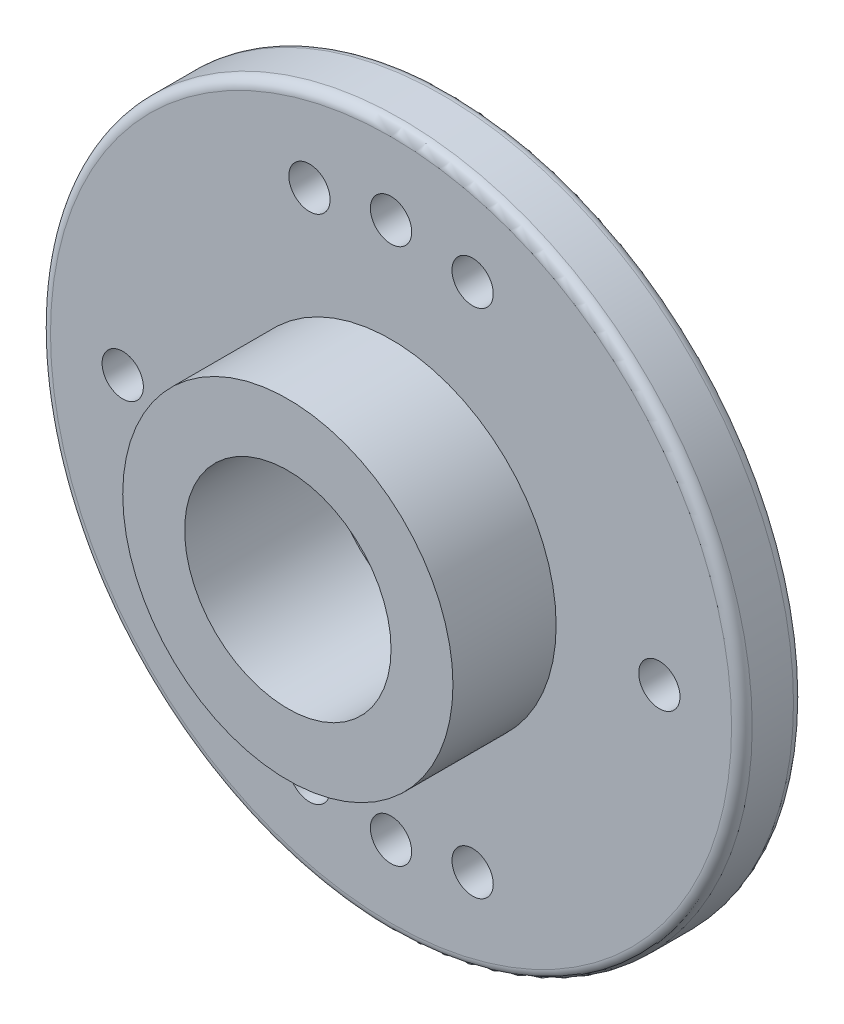
ISO-10303-21;
HEADER;
FILE_DESCRIPTION(('STEP AP214'),'2;1');
FILE_NAME('part.step','',(''),(''),'','','');
FILE_SCHEMA(('AUTOMOTIVE_DESIGN { 1 0 10303 214 1 1 1 1 }'));
ENDSEC;
DATA;
#1=APPLICATION_CONTEXT('core data for automotive mechanical design processes');
#2=APPLICATION_PROTOCOL_DEFINITION('international standard','automotive_design',2000,#1);
#3=PRODUCT_CONTEXT('',#1,'mechanical');
#4=PRODUCT('Part','Part','',(#3));
#5=PRODUCT_RELATED_PRODUCT_CATEGORY('part','',(#4));
#6=PRODUCT_DEFINITION_FORMATION('','',#4);
#7=PRODUCT_DEFINITION_CONTEXT('part definition',#1,'design');
#8=PRODUCT_DEFINITION('design','',#6,#7);
#9=PRODUCT_DEFINITION_SHAPE('','',#8);
#10=(LENGTH_UNIT() NAMED_UNIT(*) SI_UNIT(.MILLI.,.METRE.));
#11=(NAMED_UNIT(*) PLANE_ANGLE_UNIT() SI_UNIT($,.RADIAN.));
#12=(NAMED_UNIT(*) SI_UNIT($,.STERADIAN.) SOLID_ANGLE_UNIT());
#13=UNCERTAINTY_MEASURE_WITH_UNIT(LENGTH_MEASURE(1.E-05),#10,'distance_accuracy_value','');
#14=(GEOMETRIC_REPRESENTATION_CONTEXT(3) GLOBAL_UNCERTAINTY_ASSIGNED_CONTEXT((#13)) GLOBAL_UNIT_ASSIGNED_CONTEXT((#10,
#11,#12)) REPRESENTATION_CONTEXT('',''));
#15=CARTESIAN_POINT('',(0.,0.,0.));
#16=DIRECTION('',(0.,0.,1.));
#17=DIRECTION('',(1.,0.,0.));
#18=AXIS2_PLACEMENT_3D('',#15,#16,#17);
#19=CARTESIAN_POINT('',(0.,0.,0.));
#20=DIRECTION('',(0.,0.,1.));
#21=DIRECTION('',(1.,0.,0.));
#22=AXIS2_PLACEMENT_3D('',#19,#20,#21);
#23=PLANE('',#22);
#24=CARTESIAN_POINT('',(0.,0.,0.));
#25=DIRECTION('',(0.,0.,1.));
#26=DIRECTION('',(1.,0.,0.));
#27=AXIS2_PLACEMENT_3D('',#24,#25,#26);
#28=CIRCLE('',#27,1.25);
#29=CARTESIAN_POINT('',(1.25,0.,0.));
#30=VERTEX_POINT('',#29);
#31=EDGE_CURVE('E67',#30,#30,#28,.T.);
#32=ORIENTED_EDGE('',*,*,#31,.T.);
#33=EDGE_LOOP('',(#32));
#34=FACE_BOUND('',#33,.T.);
#35=CARTESIAN_POINT('',(0.,0.,0.));
#36=DIRECTION('',(0.,0.,1.));
#37=DIRECTION('',(1.,0.,0.));
#38=AXIS2_PLACEMENT_3D('',#35,#36,#37);
#39=CIRCLE('',#38,3.);
#40=CARTESIAN_POINT('',(3.,0.,0.));
#41=VERTEX_POINT('',#40);
#42=EDGE_CURVE('E58',#41,#41,#39,.T.);
#43=ORIENTED_EDGE('',*,*,#42,.F.);
#44=EDGE_LOOP('',(#43));
#45=FACE_BOUND('',#44,.T.);
#46=ADVANCED_FACE('F32',(#34,#45),#23,.F.);
#47=CARTESIAN_POINT('',(0.,0.,1.5));
#48=DIRECTION('',(0.,0.,1.));
#49=DIRECTION('',(1.,0.,0.));
#50=AXIS2_PLACEMENT_3D('',#47,#48,#49);
#51=PLANE('',#50);
#52=CARTESIAN_POINT('',(0.,0.,1.5));
#53=DIRECTION('',(0.,0.,1.));
#54=DIRECTION('',(1.,0.,0.));
#55=AXIS2_PLACEMENT_3D('',#52,#53,#54);
#56=CIRCLE('',#55,8.25);
#57=CARTESIAN_POINT('',(8.25,0.,1.5));
#58=VERTEX_POINT('',#57);
#59=EDGE_CURVE('E55',#58,#58,#56,.T.);
#60=ORIENTED_EDGE('',*,*,#59,.T.);
#61=EDGE_LOOP('',(#60));
#62=FACE_BOUND('',#61,.T.);
#63=CARTESIAN_POINT('',(0.,6.5,1.5));
#64=DIRECTION('',(0.,0.,1.));
#65=DIRECTION('',(1.,0.,0.));
#66=AXIS2_PLACEMENT_3D('',#63,#64,#65);
#67=CIRCLE('',#66,0.5);
#68=CARTESIAN_POINT('',(0.5,6.5,1.5));
#69=VERTEX_POINT('',#68);
#70=EDGE_CURVE('E95',#69,#69,#67,.T.);
#71=ORIENTED_EDGE('',*,*,#70,.F.);
#72=EDGE_LOOP('',(#71));
#73=FACE_BOUND('',#72,.T.);
#74=CARTESIAN_POINT('',(0.,-6.5,1.5));
#75=DIRECTION('',(0.,0.,1.));
#76=DIRECTION('',(1.,0.,0.));
#77=AXIS2_PLACEMENT_3D('',#74,#75,#76);
#78=CIRCLE('',#77,0.5);
#79=CARTESIAN_POINT('',(0.500000000000002,-6.5,1.5));
#80=VERTEX_POINT('',#79);
#81=EDGE_CURVE('E102',#80,#80,#78,.T.);
#82=ORIENTED_EDGE('',*,*,#81,.F.);
#83=EDGE_LOOP('',(#82));
#84=FACE_BOUND('',#83,.T.);
#85=CARTESIAN_POINT('',(-6.5,0.,1.5));
#86=DIRECTION('',(0.,0.,1.));
#87=DIRECTION('',(1.,0.,0.));
#88=AXIS2_PLACEMENT_3D('',#85,#86,#87);
#89=CIRCLE('',#88,0.500000000000001);
#90=CARTESIAN_POINT('',(-6.,0.,1.5));
#91=VERTEX_POINT('',#90);
#92=EDGE_CURVE('E105',#91,#91,#89,.T.);
#93=ORIENTED_EDGE('',*,*,#92,.F.);
#94=EDGE_LOOP('',(#93));
#95=FACE_BOUND('',#94,.T.);
#96=CARTESIAN_POINT('',(6.5,0.,1.5));
#97=DIRECTION('',(0.,0.,1.));
#98=DIRECTION('',(1.,0.,0.));
#99=AXIS2_PLACEMENT_3D('',#96,#97,#98);
#100=CIRCLE('',#99,0.500000000000001);
#101=CARTESIAN_POINT('',(7.,0.,1.5));
#102=VERTEX_POINT('',#101);
#103=EDGE_CURVE('E108',#102,#102,#100,.T.);
#104=ORIENTED_EDGE('',*,*,#103,.F.);
#105=EDGE_LOOP('',(#104));
#106=FACE_BOUND('',#105,.T.);
#107=CARTESIAN_POINT('',(-1.97618962748694,6.19230769230769,1.5));
#108=DIRECTION('',(0.,0.,1.));
#109=DIRECTION('',(1.,0.,0.));
#110=AXIS2_PLACEMENT_3D('',#107,#108,#109);
#111=CIRCLE('',#110,0.5);
#112=CARTESIAN_POINT('',(-1.47618962748694,6.19230769230769,1.5));
#113=VERTEX_POINT('',#112);
#114=EDGE_CURVE('E111',#113,#113,#111,.T.);
#115=ORIENTED_EDGE('',*,*,#114,.F.);
#116=EDGE_LOOP('',(#115));
#117=FACE_BOUND('',#116,.T.);
#118=CARTESIAN_POINT('',(1.97618962748694,6.19230769230769,1.5));
#119=DIRECTION('',(0.,0.,1.));
#120=DIRECTION('',(1.,0.,0.));
#121=AXIS2_PLACEMENT_3D('',#118,#119,#120);
#122=CIRCLE('',#121,0.499999999999999);
#123=CARTESIAN_POINT('',(2.47618962748694,6.19230769230769,1.5));
#124=VERTEX_POINT('',#123);
#125=EDGE_CURVE('E114',#124,#124,#122,.T.);
#126=ORIENTED_EDGE('',*,*,#125,.F.);
#127=EDGE_LOOP('',(#126));
#128=FACE_BOUND('',#127,.T.);
#129=CARTESIAN_POINT('',(-1.97618962748694,-6.19230769230769,1.5));
#130=DIRECTION('',(0.,0.,1.));
#131=DIRECTION('',(1.,0.,0.));
#132=AXIS2_PLACEMENT_3D('',#129,#130,#131);
#133=CIRCLE('',#132,0.5);
#134=CARTESIAN_POINT('',(-1.47618962748694,-6.19230769230769,1.5));
#135=VERTEX_POINT('',#134);
#136=EDGE_CURVE('E117',#135,#135,#133,.T.);
#137=ORIENTED_EDGE('',*,*,#136,.F.);
#138=EDGE_LOOP('',(#137));
#139=FACE_BOUND('',#138,.T.);
#140=CARTESIAN_POINT('',(1.97618962748694,-6.19230769230769,1.5));
#141=DIRECTION('',(0.,0.,1.));
#142=DIRECTION('',(1.,0.,0.));
#143=AXIS2_PLACEMENT_3D('',#140,#141,#142);
#144=CIRCLE('',#143,0.5);
#145=CARTESIAN_POINT('',(2.47618962748694,-6.19230769230769,1.5));
#146=VERTEX_POINT('',#145);
#147=EDGE_CURVE('E65',#146,#146,#144,.T.);
#148=ORIENTED_EDGE('',*,*,#147,.F.);
#149=EDGE_LOOP('',(#148));
#150=FACE_BOUND('',#149,.T.);
#151=CARTESIAN_POINT('',(0.,0.,1.5));
#152=DIRECTION('',(0.,0.,1.));
#153=DIRECTION('',(1.,0.,0.));
#154=AXIS2_PLACEMENT_3D('',#151,#152,#153);
#155=CIRCLE('',#154,4.);
#156=CARTESIAN_POINT('',(4.,0.,1.5));
#157=VERTEX_POINT('',#156);
#158=EDGE_CURVE('E62',#157,#157,#155,.F.);
#159=ORIENTED_EDGE('',*,*,#158,.T.);
#160=EDGE_LOOP('',(#159));
#161=FACE_BOUND('',#160,.T.);
#162=ADVANCED_FACE('F148',(#62,#73,#84,#95,#106,#117,#128,#139,#150,#161),#51,.T.);
#163=CARTESIAN_POINT('',(0.,0.,0.5));
#164=DIRECTION('',(0.,0.,-1.));
#165=DIRECTION('',(-1.,0.,0.));
#166=AXIS2_PLACEMENT_3D('',#163,#164,#165);
#167=CYLINDRICAL_SURFACE('',#166,8.5);
#168=CARTESIAN_POINT('',(0.,0.,1.25));
#169=DIRECTION('',(0.,0.,1.));
#170=DIRECTION('',(1.,0.,0.));
#171=AXIS2_PLACEMENT_3D('',#168,#169,#170);
#172=CIRCLE('',#171,8.5);
#173=CARTESIAN_POINT('',(8.5,0.,1.25));
#174=VERTEX_POINT('',#173);
#175=EDGE_CURVE('E49',#174,#174,#172,.F.);
#176=ORIENTED_EDGE('',*,*,#175,.T.);
#177=EDGE_LOOP('',(#176));
#178=FACE_BOUND('',#177,.T.);
#179=CARTESIAN_POINT('',(0.,0.,0.25));
#180=DIRECTION('',(0.,0.,1.));
#181=DIRECTION('',(1.,0.,0.));
#182=AXIS2_PLACEMENT_3D('',#179,#180,#181);
#183=CIRCLE('',#182,8.5);
#184=CARTESIAN_POINT('',(8.5,0.,0.25));
#185=VERTEX_POINT('',#184);
#186=EDGE_CURVE('E52',#185,#185,#183,.T.);
#187=ORIENTED_EDGE('',*,*,#186,.T.);
#188=EDGE_LOOP('',(#187));
#189=FACE_BOUND('',#188,.T.);
#190=ADVANCED_FACE('F155',(#178,#189),#167,.T.);
#191=CARTESIAN_POINT('',(0.,6.5,0.5));
#192=DIRECTION('',(0.,0.,-1.));
#193=DIRECTION('',(-1.,0.,0.));
#194=AXIS2_PLACEMENT_3D('',#191,#192,#193);
#195=CYLINDRICAL_SURFACE('',#194,0.5);
#196=CARTESIAN_POINT('',(0.,6.5,0.));
#197=DIRECTION('',(0.,0.,1.));
#198=DIRECTION('',(1.,0.,0.));
#199=AXIS2_PLACEMENT_3D('',#196,#197,#198);
#200=CIRCLE('',#199,0.5);
#201=CARTESIAN_POINT('',(0.5,6.5,0.));
#202=VERTEX_POINT('',#201);
#203=EDGE_CURVE('E71',#202,#202,#200,.T.);
#204=ORIENTED_EDGE('',*,*,#203,.F.);
#205=EDGE_LOOP('',(#204));
#206=FACE_BOUND('',#205,.T.);
#207=ORIENTED_EDGE('',*,*,#70,.T.);
#208=EDGE_LOOP('',(#207));
#209=FACE_BOUND('',#208,.T.);
#210=ADVANCED_FACE('F255',(#206,#209),#195,.F.);
#211=CARTESIAN_POINT('',(0.,-6.5,0.5));
#212=DIRECTION('',(0.,0.,-1.));
#213=DIRECTION('',(-1.,0.,0.));
#214=AXIS2_PLACEMENT_3D('',#211,#212,#213);
#215=CYLINDRICAL_SURFACE('',#214,0.5);
#216=CARTESIAN_POINT('',(0.,-6.5,0.));
#217=DIRECTION('',(0.,0.,1.));
#218=DIRECTION('',(1.,0.,0.));
#219=AXIS2_PLACEMENT_3D('',#216,#217,#218);
#220=CIRCLE('',#219,0.5);
#221=CARTESIAN_POINT('',(0.500000000000002,-6.5,0.));
#222=VERTEX_POINT('',#221);
#223=EDGE_CURVE('E74',#222,#222,#220,.T.);
#224=ORIENTED_EDGE('',*,*,#223,.F.);
#225=EDGE_LOOP('',(#224));
#226=FACE_BOUND('',#225,.T.);
#227=ORIENTED_EDGE('',*,*,#81,.T.);
#228=EDGE_LOOP('',(#227));
#229=FACE_BOUND('',#228,.T.);
#230=ADVANCED_FACE('F251',(#226,#229),#215,.F.);
#231=CARTESIAN_POINT('',(-6.5,0.,0.5));
#232=DIRECTION('',(0.,0.,-1.));
#233=DIRECTION('',(-1.,0.,0.));
#234=AXIS2_PLACEMENT_3D('',#231,#232,#233);
#235=CYLINDRICAL_SURFACE('',#234,0.500000000000001);
#236=CARTESIAN_POINT('',(-6.5,0.,0.));
#237=DIRECTION('',(0.,0.,1.));
#238=DIRECTION('',(1.,0.,0.));
#239=AXIS2_PLACEMENT_3D('',#236,#237,#238);
#240=CIRCLE('',#239,0.500000000000001);
#241=CARTESIAN_POINT('',(-6.,0.,0.));
#242=VERTEX_POINT('',#241);
#243=EDGE_CURVE('E77',#242,#242,#240,.T.);
#244=ORIENTED_EDGE('',*,*,#243,.F.);
#245=EDGE_LOOP('',(#244));
#246=FACE_BOUND('',#245,.T.);
#247=ORIENTED_EDGE('',*,*,#92,.T.);
#248=EDGE_LOOP('',(#247));
#249=FACE_BOUND('',#248,.T.);
#250=ADVANCED_FACE('F247',(#246,#249),#235,.F.);
#251=CARTESIAN_POINT('',(6.5,0.,0.5));
#252=DIRECTION('',(0.,0.,-1.));
#253=DIRECTION('',(-1.,0.,0.));
#254=AXIS2_PLACEMENT_3D('',#251,#252,#253);
#255=CYLINDRICAL_SURFACE('',#254,0.500000000000001);
#256=CARTESIAN_POINT('',(6.5,0.,0.));
#257=DIRECTION('',(0.,0.,1.));
#258=DIRECTION('',(1.,0.,0.));
#259=AXIS2_PLACEMENT_3D('',#256,#257,#258);
#260=CIRCLE('',#259,0.500000000000001);
#261=CARTESIAN_POINT('',(7.,0.,0.));
#262=VERTEX_POINT('',#261);
#263=EDGE_CURVE('E80',#262,#262,#260,.T.);
#264=ORIENTED_EDGE('',*,*,#263,.F.);
#265=EDGE_LOOP('',(#264));
#266=FACE_BOUND('',#265,.T.);
#267=ORIENTED_EDGE('',*,*,#103,.T.);
#268=EDGE_LOOP('',(#267));
#269=FACE_BOUND('',#268,.T.);
#270=ADVANCED_FACE('F243',(#266,#269),#255,.F.);
#271=CARTESIAN_POINT('',(-1.97618962748694,6.19230769230769,0.5));
#272=DIRECTION('',(0.,0.,-1.));
#273=DIRECTION('',(-1.,0.,0.));
#274=AXIS2_PLACEMENT_3D('',#271,#272,#273);
#275=CYLINDRICAL_SURFACE('',#274,0.5);
#276=CARTESIAN_POINT('',(-1.97618962748694,6.19230769230769,0.));
#277=DIRECTION('',(0.,0.,1.));
#278=DIRECTION('',(1.,0.,0.));
#279=AXIS2_PLACEMENT_3D('',#276,#277,#278);
#280=CIRCLE('',#279,0.5);
#281=CARTESIAN_POINT('',(-1.47618962748694,6.19230769230769,0.));
#282=VERTEX_POINT('',#281);
#283=EDGE_CURVE('E83',#282,#282,#280,.T.);
#284=ORIENTED_EDGE('',*,*,#283,.F.);
#285=EDGE_LOOP('',(#284));
#286=FACE_BOUND('',#285,.T.);
#287=ORIENTED_EDGE('',*,*,#114,.T.);
#288=EDGE_LOOP('',(#287));
#289=FACE_BOUND('',#288,.T.);
#290=ADVANCED_FACE('F239',(#286,#289),#275,.F.);
#291=CARTESIAN_POINT('',(1.97618962748694,6.19230769230769,0.5));
#292=DIRECTION('',(0.,0.,-1.));
#293=DIRECTION('',(-1.,0.,0.));
#294=AXIS2_PLACEMENT_3D('',#291,#292,#293);
#295=CYLINDRICAL_SURFACE('',#294,0.499999999999999);
#296=CARTESIAN_POINT('',(1.97618962748694,6.19230769230769,0.));
#297=DIRECTION('',(0.,0.,1.));
#298=DIRECTION('',(1.,0.,0.));
#299=AXIS2_PLACEMENT_3D('',#296,#297,#298);
#300=CIRCLE('',#299,0.499999999999999);
#301=CARTESIAN_POINT('',(2.47618962748694,6.19230769230769,0.));
#302=VERTEX_POINT('',#301);
#303=EDGE_CURVE('E86',#302,#302,#300,.T.);
#304=ORIENTED_EDGE('',*,*,#303,.F.);
#305=EDGE_LOOP('',(#304));
#306=FACE_BOUND('',#305,.T.);
#307=ORIENTED_EDGE('',*,*,#125,.T.);
#308=EDGE_LOOP('',(#307));
#309=FACE_BOUND('',#308,.T.);
#310=ADVANCED_FACE('F235',(#306,#309),#295,.F.);
#311=CARTESIAN_POINT('',(-1.97618962748694,-6.19230769230769,0.5));
#312=DIRECTION('',(0.,0.,-1.));
#313=DIRECTION('',(-1.,0.,0.));
#314=AXIS2_PLACEMENT_3D('',#311,#312,#313);
#315=CYLINDRICAL_SURFACE('',#314,0.5);
#316=CARTESIAN_POINT('',(-1.97618962748694,-6.19230769230769,0.));
#317=DIRECTION('',(0.,0.,1.));
#318=DIRECTION('',(1.,0.,0.));
#319=AXIS2_PLACEMENT_3D('',#316,#317,#318);
#320=CIRCLE('',#319,0.5);
#321=CARTESIAN_POINT('',(-1.47618962748694,-6.19230769230769,0.));
#322=VERTEX_POINT('',#321);
#323=EDGE_CURVE('E89',#322,#322,#320,.T.);
#324=ORIENTED_EDGE('',*,*,#323,.F.);
#325=EDGE_LOOP('',(#324));
#326=FACE_BOUND('',#325,.T.);
#327=ORIENTED_EDGE('',*,*,#136,.T.);
#328=EDGE_LOOP('',(#327));
#329=FACE_BOUND('',#328,.T.);
#330=ADVANCED_FACE('F195',(#326,#329),#315,.F.);
#331=CARTESIAN_POINT('',(1.97618962748694,-6.19230769230769,0.5));
#332=DIRECTION('',(0.,0.,-1.));
#333=DIRECTION('',(-1.,0.,0.));
#334=AXIS2_PLACEMENT_3D('',#331,#332,#333);
#335=CYLINDRICAL_SURFACE('',#334,0.5);
#336=CARTESIAN_POINT('',(1.97618962748694,-6.19230769230769,0.));
#337=DIRECTION('',(0.,0.,1.));
#338=DIRECTION('',(1.,0.,0.));
#339=AXIS2_PLACEMENT_3D('',#336,#337,#338);
#340=CIRCLE('',#339,0.5);
#341=CARTESIAN_POINT('',(2.47618962748694,-6.19230769230769,0.));
#342=VERTEX_POINT('',#341);
#343=EDGE_CURVE('E92',#342,#342,#340,.T.);
#344=ORIENTED_EDGE('',*,*,#343,.F.);
#345=EDGE_LOOP('',(#344));
#346=FACE_BOUND('',#345,.T.);
#347=ORIENTED_EDGE('',*,*,#147,.T.);
#348=EDGE_LOOP('',(#347));
#349=FACE_BOUND('',#348,.T.);
#350=ADVANCED_FACE('F192',(#346,#349),#335,.F.);
#351=CARTESIAN_POINT('',(0.,0.,0.5));
#352=DIRECTION('',(0.,0.,-1.));
#353=DIRECTION('',(-1.,0.,0.));
#354=AXIS2_PLACEMENT_3D('',#351,#352,#353);
#355=CYLINDRICAL_SURFACE('',#354,1.25);
#356=CARTESIAN_POINT('',(0.,0.,0.5));
#357=DIRECTION('',(0.,0.,1.));
#358=DIRECTION('',(1.,0.,0.));
#359=AXIS2_PLACEMENT_3D('',#356,#357,#358);
#360=CIRCLE('',#359,1.25);
#361=CARTESIAN_POINT('',(1.25,0.,0.5));
#362=VERTEX_POINT('',#361);
#363=EDGE_CURVE('E70',#362,#362,#360,.T.);
#364=ORIENTED_EDGE('',*,*,#363,.T.);
#365=EDGE_LOOP('',(#364));
#366=FACE_BOUND('',#365,.T.);
#367=ORIENTED_EDGE('',*,*,#31,.F.);
#368=EDGE_LOOP('',(#367));
#369=FACE_BOUND('',#368,.T.);
#370=ADVANCED_FACE('F172',(#366,#369),#355,.F.);
#371=CARTESIAN_POINT('',(0.,0.,0.5));
#372=DIRECTION('',(0.,0.,1.));
#373=DIRECTION('',(1.,0.,0.));
#374=AXIS2_PLACEMENT_3D('',#371,#372,#373);
#375=PLANE('',#374);
#376=CARTESIAN_POINT('',(0.,0.,0.5));
#377=DIRECTION('',(0.,0.,1.));
#378=DIRECTION('',(1.,0.,0.));
#379=AXIS2_PLACEMENT_3D('',#376,#377,#378);
#380=CIRCLE('',#379,2.5);
#381=CARTESIAN_POINT('',(2.5,0.,0.5));
#382=VERTEX_POINT('',#381);
#383=EDGE_CURVE('E61',#382,#382,#380,.F.);
#384=ORIENTED_EDGE('',*,*,#383,.F.);
#385=EDGE_LOOP('',(#384));
#386=FACE_BOUND('',#385,.T.);
#387=ORIENTED_EDGE('',*,*,#363,.F.);
#388=EDGE_LOOP('',(#387));
#389=FACE_BOUND('',#388,.T.);
#390=ADVANCED_FACE('F163',(#386,#389),#375,.T.);
#391=CARTESIAN_POINT('',(0.,0.,0.));
#392=DIRECTION('',(0.,0.,1.));
#393=DIRECTION('',(1.,0.,0.));
#394=AXIS2_PLACEMENT_3D('',#391,#392,#393);
#395=CIRCLE('',#394,8.25);
#396=CARTESIAN_POINT('',(8.25,0.,0.));
#397=VERTEX_POINT('',#396);
#398=EDGE_CURVE('E44',#397,#397,#395,.F.);
#399=ORIENTED_EDGE('',*,*,#398,.T.);
#400=EDGE_LOOP('',(#399));
#401=FACE_BOUND('',#400,.T.);
#402=CARTESIAN_POINT('',(0.,0.,0.));
#403=DIRECTION('',(0.,0.,1.));
#404=DIRECTION('',(1.,0.,0.));
#405=AXIS2_PLACEMENT_3D('',#402,#403,#404);
#406=CIRCLE('',#405,3.5);
#407=CARTESIAN_POINT('',(3.5,0.,0.));
#408=VERTEX_POINT('',#407);
#409=EDGE_CURVE('E127',#408,#408,#406,.T.);
#410=ORIENTED_EDGE('',*,*,#409,.T.);
#411=EDGE_LOOP('',(#410));
#412=FACE_BOUND('',#411,.T.);
#413=ORIENTED_EDGE('',*,*,#203,.T.);
#414=EDGE_LOOP('',(#413));
#415=FACE_BOUND('',#414,.T.);
#416=ORIENTED_EDGE('',*,*,#223,.T.);
#417=EDGE_LOOP('',(#416));
#418=FACE_BOUND('',#417,.T.);
#419=ORIENTED_EDGE('',*,*,#243,.T.);
#420=EDGE_LOOP('',(#419));
#421=FACE_BOUND('',#420,.T.);
#422=ORIENTED_EDGE('',*,*,#263,.T.);
#423=EDGE_LOOP('',(#422));
#424=FACE_BOUND('',#423,.T.);
#425=ORIENTED_EDGE('',*,*,#283,.T.);
#426=EDGE_LOOP('',(#425));
#427=FACE_BOUND('',#426,.T.);
#428=ORIENTED_EDGE('',*,*,#303,.T.);
#429=EDGE_LOOP('',(#428));
#430=FACE_BOUND('',#429,.T.);
#431=ORIENTED_EDGE('',*,*,#323,.T.);
#432=EDGE_LOOP('',(#431));
#433=FACE_BOUND('',#432,.T.);
#434=ORIENTED_EDGE('',*,*,#343,.T.);
#435=EDGE_LOOP('',(#434));
#436=FACE_BOUND('',#435,.T.);
#437=ADVANCED_FACE('F151',(#401,#412,#415,#418,#421,#424,#427,#430,#433,#436),#23,.F.);
#438=CARTESIAN_POINT('',(0.,0.,1.5));
#439=DIRECTION('',(0.,0.,-1.));
#440=DIRECTION('',(-1.,0.,0.));
#441=AXIS2_PLACEMENT_3D('',#438,#439,#440);
#442=CYLINDRICAL_SURFACE('',#441,2.5);
#443=ORIENTED_EDGE('',*,*,#383,.T.);
#444=EDGE_LOOP('',(#443));
#445=FACE_BOUND('',#444,.T.);
#446=CARTESIAN_POINT('',(0.,0.,4.));
#447=DIRECTION('',(0.,0.,1.));
#448=DIRECTION('',(1.,0.,0.));
#449=AXIS2_PLACEMENT_3D('',#446,#447,#448);
#450=CIRCLE('',#449,2.5);
#451=CARTESIAN_POINT('',(2.5,0.,4.));
#452=VERTEX_POINT('',#451);
#453=EDGE_CURVE('E66',#452,#452,#450,.T.);
#454=ORIENTED_EDGE('',*,*,#453,.T.);
#455=EDGE_LOOP('',(#454));
#456=FACE_BOUND('',#455,.T.);
#457=ADVANCED_FACE('F162',(#445,#456),#442,.F.);
#458=CARTESIAN_POINT('',(0.,0.,4.));
#459=DIRECTION('',(0.,0.,-1.));
#460=DIRECTION('',(-1.,0.,0.));
#461=AXIS2_PLACEMENT_3D('',#458,#459,#460);
#462=CYLINDRICAL_SURFACE('',#461,4.);
#463=ORIENTED_EDGE('',*,*,#158,.F.);
#464=EDGE_LOOP('',(#463));
#465=FACE_BOUND('',#464,.T.);
#466=CARTESIAN_POINT('',(0.,0.,4.));
#467=DIRECTION('',(0.,0.,1.));
#468=DIRECTION('',(1.,0.,0.));
#469=AXIS2_PLACEMENT_3D('',#466,#467,#468);
#470=CIRCLE('',#469,4.);
#471=CARTESIAN_POINT('',(4.,0.,4.));
#472=VERTEX_POINT('',#471);
#473=EDGE_CURVE('E124',#472,#472,#470,.T.);
#474=ORIENTED_EDGE('',*,*,#473,.F.);
#475=EDGE_LOOP('',(#474));
#476=FACE_BOUND('',#475,.T.);
#477=ADVANCED_FACE('F169',(#465,#476),#462,.T.);
#478=CARTESIAN_POINT('',(0.,0.,4.));
#479=DIRECTION('',(0.,0.,1.));
#480=DIRECTION('',(1.,0.,0.));
#481=AXIS2_PLACEMENT_3D('',#478,#479,#480);
#482=PLANE('',#481);
#483=ORIENTED_EDGE('',*,*,#473,.T.);
#484=EDGE_LOOP('',(#483));
#485=FACE_BOUND('',#484,.T.);
#486=ORIENTED_EDGE('',*,*,#453,.F.);
#487=EDGE_LOOP('',(#486));
#488=FACE_BOUND('',#487,.T.);
#489=ADVANCED_FACE('F204',(#485,#488),#482,.T.);
#490=CARTESIAN_POINT('',(0.,0.,-1.));
#491=DIRECTION('',(0.,0.,1.));
#492=DIRECTION('',(1.,0.,0.));
#493=AXIS2_PLACEMENT_3D('',#490,#491,#492);
#494=CYLINDRICAL_SURFACE('',#493,3.);
#495=CARTESIAN_POINT('',(0.,0.,-0.75));
#496=DIRECTION('',(0.,0.,1.));
#497=DIRECTION('',(1.,0.,0.));
#498=AXIS2_PLACEMENT_3D('',#495,#496,#497);
#499=CIRCLE('',#498,3.);
#500=CARTESIAN_POINT('',(3.,0.,-0.75));
#501=VERTEX_POINT('',#500);
#502=EDGE_CURVE('E40',#501,#501,#499,.F.);
#503=ORIENTED_EDGE('',*,*,#502,.T.);
#504=EDGE_LOOP('',(#503));
#505=FACE_BOUND('',#504,.T.);
#506=ORIENTED_EDGE('',*,*,#42,.T.);
#507=EDGE_LOOP('',(#506));
#508=FACE_BOUND('',#507,.T.);
#509=ADVANCED_FACE('F210',(#505,#508),#494,.F.);
#510=CARTESIAN_POINT('',(0.,0.,-1.));
#511=DIRECTION('',(0.,0.,1.));
#512=DIRECTION('',(1.,0.,0.));
#513=AXIS2_PLACEMENT_3D('',#510,#511,#512);
#514=CYLINDRICAL_SURFACE('',#513,3.5);
#515=CARTESIAN_POINT('',(0.,0.,-0.75));
#516=DIRECTION('',(0.,0.,1.));
#517=DIRECTION('',(1.,0.,0.));
#518=AXIS2_PLACEMENT_3D('',#515,#516,#517);
#519=CIRCLE('',#518,3.5);
#520=CARTESIAN_POINT('',(3.5,0.,-0.75));
#521=VERTEX_POINT('',#520);
#522=EDGE_CURVE('E10',#521,#521,#519,.T.);
#523=ORIENTED_EDGE('',*,*,#522,.T.);
#524=EDGE_LOOP('',(#523));
#525=FACE_BOUND('',#524,.T.);
#526=ORIENTED_EDGE('',*,*,#409,.F.);
#527=EDGE_LOOP('',(#526));
#528=FACE_BOUND('',#527,.T.);
#529=ADVANCED_FACE('F217',(#525,#528),#514,.T.);
#530=CARTESIAN_POINT('',(0.,0.,1.25));
#531=DIRECTION('',(0.,0.,1.));
#532=DIRECTION('',(1.,0.,0.));
#533=AXIS2_PLACEMENT_3D('',#530,#531,#532);
#534=TOROIDAL_SURFACE('',#533,8.25,0.25);
#535=ORIENTED_EDGE('',*,*,#175,.F.);
#536=EDGE_LOOP('',(#535));
#537=FACE_BOUND('',#536,.T.);
#538=ORIENTED_EDGE('',*,*,#59,.F.);
#539=EDGE_LOOP('',(#538));
#540=FACE_BOUND('',#539,.T.);
#541=ADVANCED_FACE('F144',(#537,#540),#534,.T.);
#542=CARTESIAN_POINT('',(0.,0.,0.25));
#543=DIRECTION('',(0.,0.,1.));
#544=DIRECTION('',(1.,0.,0.));
#545=AXIS2_PLACEMENT_3D('',#542,#543,#544);
#546=TOROIDAL_SURFACE('',#545,8.25,0.25);
#547=ORIENTED_EDGE('',*,*,#398,.F.);
#548=EDGE_LOOP('',(#547));
#549=FACE_BOUND('',#548,.T.);
#550=ORIENTED_EDGE('',*,*,#186,.F.);
#551=EDGE_LOOP('',(#550));
#552=FACE_BOUND('',#551,.T.);
#553=ADVANCED_FACE('F137',(#549,#552),#546,.T.);
#554=CARTESIAN_POINT('',(0.,0.,-0.75));
#555=DIRECTION('',(0.,0.,1.));
#556=DIRECTION('',(1.,0.,0.));
#557=AXIS2_PLACEMENT_3D('',#554,#555,#556);
#558=TOROIDAL_SURFACE('',#557,3.25,0.25);
#559=ORIENTED_EDGE('',*,*,#522,.F.);
#560=EDGE_LOOP('',(#559));
#561=FACE_BOUND('',#560,.T.);
#562=CARTESIAN_POINT('',(0.,0.,-1.));
#563=DIRECTION('',(0.,0.,1.));
#564=DIRECTION('',(1.,0.,0.));
#565=AXIS2_PLACEMENT_3D('',#562,#563,#564);
#566=CIRCLE('',#565,3.25);
#567=CARTESIAN_POINT('',(3.25,0.,-1.));
#568=VERTEX_POINT('',#567);
#569=EDGE_CURVE('E36',#568,#568,#566,.F.);
#570=ORIENTED_EDGE('',*,*,#569,.F.);
#571=EDGE_LOOP('',(#570));
#572=FACE_BOUND('',#571,.T.);
#573=ADVANCED_FACE('F34',(#561,#572),#558,.T.);
#574=CARTESIAN_POINT('',(0.,0.,-0.75));
#575=DIRECTION('',(0.,0.,1.));
#576=DIRECTION('',(1.,0.,0.));
#577=AXIS2_PLACEMENT_3D('',#574,#575,#576);
#578=TOROIDAL_SURFACE('',#577,3.25,0.25);
#579=ORIENTED_EDGE('',*,*,#502,.F.);
#580=EDGE_LOOP('',(#579));
#581=FACE_BOUND('',#580,.T.);
#582=ORIENTED_EDGE('',*,*,#569,.T.);
#583=EDGE_LOOP('',(#582));
#584=FACE_BOUND('',#583,.T.);
#585=ADVANCED_FACE('F134',(#581,#584),#578,.T.);
#586=CLOSED_SHELL('',(#46,#162,#190,#210,#230,#250,#270,#290,#310,#330,#350,#370,#390,#437,#457,
#477,#489,#509,#529,#541,#553,#573,#585));
#587=MANIFOLD_SOLID_BREP('B2',#586);
#588=ADVANCED_BREP_SHAPE_REPRESENTATION('',(#18,#587),#14);
#589=SHAPE_DEFINITION_REPRESENTATION(#9,#588);
ENDSEC;
END-ISO-10303-21;
